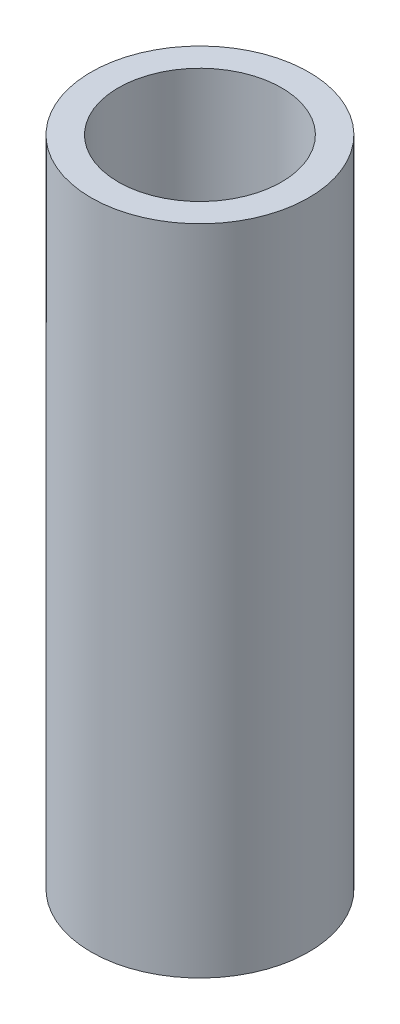
ISO-10303-21;
HEADER;
FILE_DESCRIPTION(('STEP AP214'),'2;1');
FILE_NAME('part.step','',(''),(''),'','','');
FILE_SCHEMA(('AUTOMOTIVE_DESIGN { 1 0 10303 214 1 1 1 1 }'));
ENDSEC;
DATA;
#1=APPLICATION_CONTEXT('core data for automotive mechanical design processes');
#2=APPLICATION_PROTOCOL_DEFINITION('international standard','automotive_design',2000,#1);
#3=PRODUCT_CONTEXT('',#1,'mechanical');
#4=PRODUCT('Part','Part','',(#3));
#5=PRODUCT_RELATED_PRODUCT_CATEGORY('part','',(#4));
#6=PRODUCT_DEFINITION_FORMATION('','',#4);
#7=PRODUCT_DEFINITION_CONTEXT('part definition',#1,'design');
#8=PRODUCT_DEFINITION('design','',#6,#7);
#9=PRODUCT_DEFINITION_SHAPE('','',#8);
#10=(LENGTH_UNIT() NAMED_UNIT(*) SI_UNIT(.MILLI.,.METRE.));
#11=(NAMED_UNIT(*) PLANE_ANGLE_UNIT() SI_UNIT($,.RADIAN.));
#12=(NAMED_UNIT(*) SI_UNIT($,.STERADIAN.) SOLID_ANGLE_UNIT());
#13=UNCERTAINTY_MEASURE_WITH_UNIT(LENGTH_MEASURE(1.E-05),#10,'distance_accuracy_value','');
#14=(GEOMETRIC_REPRESENTATION_CONTEXT(3) GLOBAL_UNCERTAINTY_ASSIGNED_CONTEXT((#13)) GLOBAL_UNIT_ASSIGNED_CONTEXT((#10,
#11,#12)) REPRESENTATION_CONTEXT('',''));
#15=CARTESIAN_POINT('',(0.,0.,0.));
#16=DIRECTION('',(0.,0.,1.));
#17=DIRECTION('',(1.,0.,0.));
#18=AXIS2_PLACEMENT_3D('',#15,#16,#17);
#19=CARTESIAN_POINT('',(0.,76.2,0.));
#20=DIRECTION('',(0.,1.,0.));
#21=DIRECTION('',(0.,0.,1.));
#22=AXIS2_PLACEMENT_3D('',#19,#20,#21);
#23=PLANE('',#22);
#24=CARTESIAN_POINT('',(0.,76.2,0.));
#25=DIRECTION('',(0.,1.,0.));
#26=DIRECTION('',(0.,0.,1.));
#27=AXIS2_PLACEMENT_3D('',#24,#25,#26);
#28=CIRCLE('',#27,12.7);
#29=CARTESIAN_POINT('',(0.,76.2,12.7));
#30=VERTEX_POINT('',#29);
#31=EDGE_CURVE('E10',#30,#30,#28,.T.);
#32=ORIENTED_EDGE('',*,*,#31,.T.);
#33=EDGE_LOOP('',(#32));
#34=FACE_BOUND('',#33,.T.);
#35=CARTESIAN_POINT('',(0.,76.2,0.));
#36=DIRECTION('',(0.,1.,0.));
#37=DIRECTION('',(0.,0.,1.));
#38=AXIS2_PLACEMENT_3D('',#35,#36,#37);
#39=CIRCLE('',#38,9.52500000000002);
#40=CARTESIAN_POINT('',(0.,76.2,9.52500000000002));
#41=VERTEX_POINT('',#40);
#42=EDGE_CURVE('E44',#41,#41,#39,.T.);
#43=ORIENTED_EDGE('',*,*,#42,.F.);
#44=EDGE_LOOP('',(#43));
#45=FACE_BOUND('',#44,.T.);
#46=ADVANCED_FACE('F33',(#34,#45),#23,.T.);
#47=CARTESIAN_POINT('',(0.,0.,0.));
#48=DIRECTION('',(0.,1.,0.));
#49=DIRECTION('',(0.,0.,1.));
#50=AXIS2_PLACEMENT_3D('',#47,#48,#49);
#51=PLANE('',#50);
#52=CARTESIAN_POINT('',(0.,0.,0.));
#53=DIRECTION('',(0.,1.,0.));
#54=DIRECTION('',(0.,0.,1.));
#55=AXIS2_PLACEMENT_3D('',#52,#53,#54);
#56=CIRCLE('',#55,12.7);
#57=CARTESIAN_POINT('',(0.,0.,12.7));
#58=VERTEX_POINT('',#57);
#59=EDGE_CURVE('E37',#58,#58,#56,.T.);
#60=ORIENTED_EDGE('',*,*,#59,.F.);
#61=EDGE_LOOP('',(#60));
#62=FACE_BOUND('',#61,.T.);
#63=CARTESIAN_POINT('',(0.,0.,0.));
#64=DIRECTION('',(0.,1.,0.));
#65=DIRECTION('',(0.,0.,1.));
#66=AXIS2_PLACEMENT_3D('',#63,#64,#65);
#67=CIRCLE('',#66,9.52500000000002);
#68=CARTESIAN_POINT('',(0.,0.,9.52500000000002));
#69=VERTEX_POINT('',#68);
#70=EDGE_CURVE('E46',#69,#69,#67,.T.);
#71=ORIENTED_EDGE('',*,*,#70,.T.);
#72=EDGE_LOOP('',(#71));
#73=FACE_BOUND('',#72,.T.);
#74=ADVANCED_FACE('F56',(#62,#73),#51,.F.);
#75=CARTESIAN_POINT('',(0.,76.2,0.));
#76=DIRECTION('',(0.,-1.,0.));
#77=DIRECTION('',(0.,0.,-1.));
#78=AXIS2_PLACEMENT_3D('',#75,#76,#77);
#79=CYLINDRICAL_SURFACE('',#78,12.7);
#80=ORIENTED_EDGE('',*,*,#31,.F.);
#81=EDGE_LOOP('',(#80));
#82=FACE_BOUND('',#81,.T.);
#83=ORIENTED_EDGE('',*,*,#59,.T.);
#84=EDGE_LOOP('',(#83));
#85=FACE_BOUND('',#84,.T.);
#86=ADVANCED_FACE('F35',(#82,#85),#79,.T.);
#87=CARTESIAN_POINT('',(0.,76.2,0.));
#88=DIRECTION('',(0.,-1.,0.));
#89=DIRECTION('',(0.,0.,-1.));
#90=AXIS2_PLACEMENT_3D('',#87,#88,#89);
#91=CYLINDRICAL_SURFACE('',#90,9.52500000000002);
#92=ORIENTED_EDGE('',*,*,#42,.T.);
#93=EDGE_LOOP('',(#92));
#94=FACE_BOUND('',#93,.T.);
#95=ORIENTED_EDGE('',*,*,#70,.F.);
#96=EDGE_LOOP('',(#95));
#97=FACE_BOUND('',#96,.T.);
#98=ADVANCED_FACE('F52',(#94,#97),#91,.F.);
#99=CLOSED_SHELL('',(#46,#74,#86,#98));
#100=MANIFOLD_SOLID_BREP('B2',#99);
#101=ADVANCED_BREP_SHAPE_REPRESENTATION('',(#18,#100),#14);
#102=SHAPE_DEFINITION_REPRESENTATION(#9,#101);
ENDSEC;
END-ISO-10303-21;
